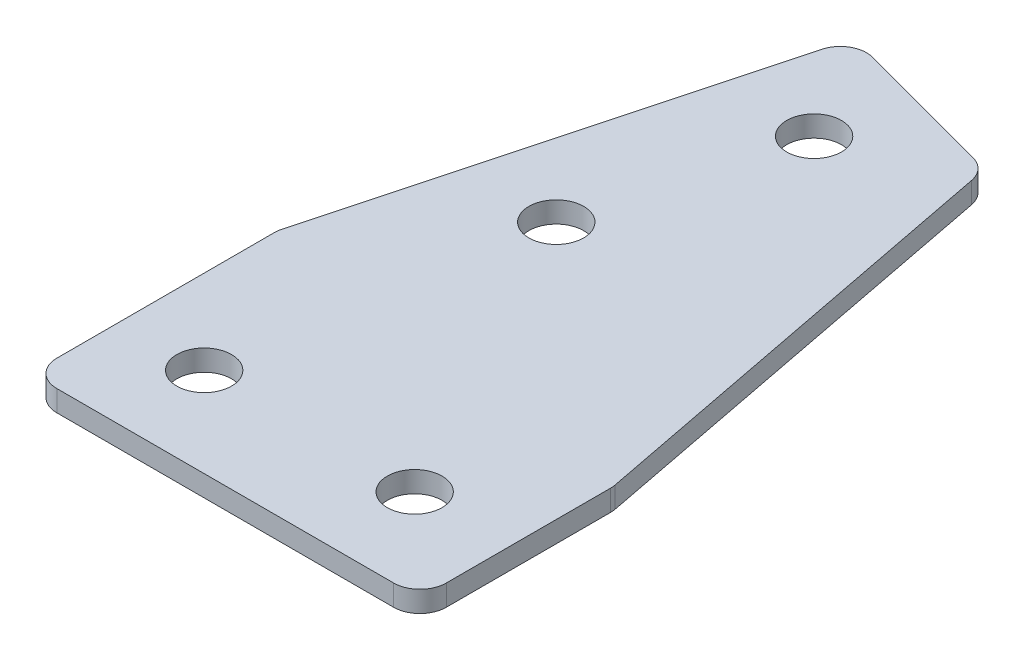
ISO-10303-21;
HEADER;
FILE_DESCRIPTION(('STEP AP214'),'2;1');
FILE_NAME('part.step','',(''),(''),'','','');
FILE_SCHEMA(('AUTOMOTIVE_DESIGN { 1 0 10303 214 1 1 1 1 }'));
ENDSEC;
DATA;
#1=APPLICATION_CONTEXT('core data for automotive mechanical design processes');
#2=APPLICATION_PROTOCOL_DEFINITION('international standard','automotive_design',2000,#1);
#3=PRODUCT_CONTEXT('',#1,'mechanical');
#4=PRODUCT('Part','Part','',(#3));
#5=PRODUCT_RELATED_PRODUCT_CATEGORY('part','',(#4));
#6=PRODUCT_DEFINITION_FORMATION('','',#4);
#7=PRODUCT_DEFINITION_CONTEXT('part definition',#1,'design');
#8=PRODUCT_DEFINITION('design','',#6,#7);
#9=PRODUCT_DEFINITION_SHAPE('','',#8);
#10=(LENGTH_UNIT() NAMED_UNIT(*) SI_UNIT(.MILLI.,.METRE.));
#11=(NAMED_UNIT(*) PLANE_ANGLE_UNIT() SI_UNIT($,.RADIAN.));
#12=(NAMED_UNIT(*) SI_UNIT($,.STERADIAN.) SOLID_ANGLE_UNIT());
#13=UNCERTAINTY_MEASURE_WITH_UNIT(LENGTH_MEASURE(1.E-05),#10,'distance_accuracy_value','');
#14=(GEOMETRIC_REPRESENTATION_CONTEXT(3) GLOBAL_UNCERTAINTY_ASSIGNED_CONTEXT((#13)) GLOBAL_UNIT_ASSIGNED_CONTEXT((#10,
#11,#12)) REPRESENTATION_CONTEXT('',''));
#15=CARTESIAN_POINT('',(0.,0.,0.));
#16=DIRECTION('',(0.,0.,1.));
#17=DIRECTION('',(1.,0.,0.));
#18=AXIS2_PLACEMENT_3D('',#15,#16,#17);
#19=CARTESIAN_POINT('',(0.,0.,0.));
#20=DIRECTION('',(0.,1.,0.));
#21=DIRECTION('',(0.,0.,1.));
#22=AXIS2_PLACEMENT_3D('',#19,#20,#21);
#23=PLANE('',#22);
#24=CARTESIAN_POINT('',(23.2137372026378,0.,0.));
#25=DIRECTION('',(0.,1.,0.));
#26=DIRECTION('',(0.,0.,1.));
#27=AXIS2_PLACEMENT_3D('',#24,#25,#26);
#28=CIRCLE('',#27,2.6);
#29=CARTESIAN_POINT('',(23.2137372026378,0.,2.6));
#30=VERTEX_POINT('',#29);
#31=EDGE_CURVE('E349',#30,#30,#28,.T.);
#32=ORIENTED_EDGE('',*,*,#31,.T.);
#33=EDGE_LOOP('',(#32));
#34=FACE_BOUND('',#33,.T.);
#35=CARTESIAN_POINT('',(12.9246670761904,0.,-48.2355141992285));
#36=DIRECTION('',(0.,1.,0.));
#37=DIRECTION('',(0.,0.,1.));
#38=AXIS2_PLACEMENT_3D('',#35,#36,#37);
#39=CIRCLE('',#38,2.60000000000001);
#40=CARTESIAN_POINT('',(12.9246670761904,0.,-45.6355141992285));
#41=VERTEX_POINT('',#40);
#42=EDGE_CURVE('E343',#41,#41,#39,.T.);
#43=ORIENTED_EDGE('',*,*,#42,.T.);
#44=EDGE_LOOP('',(#43));
#45=FACE_BOUND('',#44,.T.);
#46=CARTESIAN_POINT('',(7.74828617414003,0.,-28.9169976734471));
#47=DIRECTION('',(0.,1.,0.));
#48=DIRECTION('',(0.,0.,1.));
#49=AXIS2_PLACEMENT_3D('',#46,#47,#48);
#50=CIRCLE('',#49,2.6);
#51=CARTESIAN_POINT('',(7.74828617414003,0.,-26.3169976734471));
#52=VERTEX_POINT('',#51);
#53=EDGE_CURVE('E359',#52,#52,#50,.T.);
#54=ORIENTED_EDGE('',*,*,#53,.T.);
#55=EDGE_LOOP('',(#54));
#56=FACE_BOUND('',#55,.T.);
#57=CARTESIAN_POINT('',(3.2137372026378,0.,0.));
#58=DIRECTION('',(0.,1.,0.));
#59=DIRECTION('',(0.,0.,1.));
#60=AXIS2_PLACEMENT_3D('',#57,#58,#59);
#61=CIRCLE('',#60,2.6);
#62=CARTESIAN_POINT('',(3.2137372026378,0.,2.60000000000001));
#63=VERTEX_POINT('',#62);
#64=EDGE_CURVE('E255',#63,#63,#61,.T.);
#65=ORIENTED_EDGE('',*,*,#64,.T.);
#66=EDGE_LOOP('',(#65));
#67=FACE_BOUND('',#66,.T.);
#68=DIRECTION('',(0.,0.,-1.));
#69=VECTOR('',#68,1.);
#70=CARTESIAN_POINT('',(32.2137372026378,0.,8.50000000000013));
#71=LINE('',#70,#69);
#72=CARTESIAN_POINT('',(32.2137372026378,0.,6.00000000000013));
#73=VERTEX_POINT('',#72);
#74=CARTESIAN_POINT('',(32.2137372026378,0.,-9.61665780509915));
#75=VERTEX_POINT('',#74);
#76=EDGE_CURVE('E238',#73,#75,#71,.T.);
#77=ORIENTED_EDGE('',*,*,#76,.F.);
#78=CARTESIAN_POINT('',(29.7137372026378,0.,6.00000000000013));
#79=DIRECTION('',(0.,1.,0.));
#80=DIRECTION('',(0.,0.,1.));
#81=AXIS2_PLACEMENT_3D('',#78,#79,#80);
#82=CIRCLE('',#81,2.5);
#83=CARTESIAN_POINT('',(29.7137372026378,0.,8.50000000000013));
#84=VERTEX_POINT('',#83);
#85=EDGE_CURVE('E204',#73,#84,#82,.F.);
#86=ORIENTED_EDGE('',*,*,#85,.T.);
#87=DIRECTION('',(1.,0.,0.));
#88=VECTOR('',#87,1.);
#89=CARTESIAN_POINT('',(-4.78626279736219,0.,8.50000000000013));
#90=LINE('',#89,#88);
#91=CARTESIAN_POINT('',(-2.28626279736219,0.,8.50000000000013));
#92=VERTEX_POINT('',#91);
#93=EDGE_CURVE('E232',#92,#84,#90,.T.);
#94=ORIENTED_EDGE('',*,*,#93,.F.);
#95=CARTESIAN_POINT('',(-2.28626279736219,0.,6.00000000000013));
#96=DIRECTION('',(0.,1.,0.));
#97=DIRECTION('',(0.,0.,1.));
#98=AXIS2_PLACEMENT_3D('',#95,#96,#97);
#99=CIRCLE('',#98,2.5);
#100=CARTESIAN_POINT('',(-4.78626279736219,0.,6.00000000000013));
#101=VERTEX_POINT('',#100);
#102=EDGE_CURVE('E59',#92,#101,#99,.F.);
#103=ORIENTED_EDGE('',*,*,#102,.T.);
#104=DIRECTION('',(0.,0.,1.));
#105=VECTOR('',#104,1.);
#106=CARTESIAN_POINT('',(-4.78626279736219,0.,-14.9789021556695));
#107=LINE('',#106,#105);
#108=CARTESIAN_POINT('',(-4.78626279736219,0.,-14.649770911701));
#109=VERTEX_POINT('',#108);
#110=EDGE_CURVE('E229',#109,#101,#107,.T.);
#111=ORIENTED_EDGE('',*,*,#110,.F.);
#112=CARTESIAN_POINT('',(-2.28626279736219,0.,-14.649770911701));
#113=DIRECTION('',(0.,1.,0.));
#114=DIRECTION('',(0.,0.,1.));
#115=AXIS2_PLACEMENT_3D('',#112,#113,#114);
#116=CIRCLE('',#115,2.5);
#117=CARTESIAN_POINT('',(-4.70107736308486,0.,-15.2968185244573));
#118=VERTEX_POINT('',#117);
#119=EDGE_CURVE('E195',#109,#118,#116,.F.);
#120=ORIENTED_EDGE('',*,*,#119,.T.);
#121=DIRECTION('',(-0.258819045102518,0.,0.965925826289069));
#122=VECTOR('',#121,1.);
#123=CARTESIAN_POINT('',(6.78484991355328,0.,-58.1628826929125));
#124=LINE('',#123,#122);
#125=CARTESIAN_POINT('',(6.13780230079699,0.,-55.7480681271898));
#126=VERTEX_POINT('',#125);
#127=EDGE_CURVE('E233',#126,#118,#124,.T.);
#128=ORIENTED_EDGE('',*,*,#127,.F.);
#129=CARTESIAN_POINT('',(8.55261686651966,0.,-55.1010205144335));
#130=DIRECTION('',(0.,1.,0.));
#131=DIRECTION('',(0.,0.,1.));
#132=AXIS2_PLACEMENT_3D('',#129,#130,#131);
#133=CIRCLE('',#132,2.5);
#134=CARTESIAN_POINT('',(9.19966447927595,0.,-57.5158350801562));
#135=VERTEX_POINT('',#134);
#136=EDGE_CURVE('E190',#126,#135,#133,.F.);
#137=ORIENTED_EDGE('',*,*,#136,.T.);
#138=DIRECTION('',(-0.965925826289069,0.,-0.258819045102517));
#139=VECTOR('',#138,1.);
#140=CARTESIAN_POINT('',(23.7482060008003,0.,-53.6175651284132));
#141=LINE('',#140,#139);
#142=CARTESIAN_POINT('',(22.2377531689653,0.,-54.0222897449087));
#143=VERTEX_POINT('',#142);
#144=EDGE_CURVE('E158',#143,#135,#141,.T.);
#145=ORIENTED_EDGE('',*,*,#144,.F.);
#146=CARTESIAN_POINT('',(21.590705556209,0.,-51.607475179186));
#147=DIRECTION('',(0.,1.,0.));
#148=DIRECTION('',(0.,0.,1.));
#149=AXIS2_PLACEMENT_3D('',#146,#147,#148);
#150=CIRCLE('',#149,2.5);
#151=CARTESIAN_POINT('',(24.0452012265613,0.,-52.082291990411));
#152=VERTEX_POINT('',#151);
#153=EDGE_CURVE('E198',#143,#152,#150,.F.);
#154=ORIENTED_EDGE('',*,*,#153,.T.);
#155=DIRECTION('',(-0.18992672448999,0.,-0.981798268140917));
#156=VECTOR('',#155,1.);
#157=CARTESIAN_POINT('',(32.2137372026378,0.,-9.85624667691222));
#158=LINE('',#157,#156);
#159=CARTESIAN_POINT('',(32.1682328729901,0.,-10.0914746163241));
#160=VERTEX_POINT('',#159);
#161=EDGE_CURVE('E165',#160,#152,#158,.T.);
#162=ORIENTED_EDGE('',*,*,#161,.F.);
#163=CARTESIAN_POINT('',(29.7137372026378,0.,-9.61665780509915));
#164=DIRECTION('',(0.,1.,0.));
#165=DIRECTION('',(0.,0.,1.));
#166=AXIS2_PLACEMENT_3D('',#163,#164,#165);
#167=CIRCLE('',#166,2.5);
#168=EDGE_CURVE('E201',#160,#75,#167,.F.);
#169=ORIENTED_EDGE('',*,*,#168,.T.);
#170=EDGE_LOOP('',(#77,#86,#94,#103,#111,#120,#128,#137,#145,#154,#162,#169));
#171=FACE_BOUND('',#170,.T.);
#172=ADVANCED_FACE('F43',(#34,#45,#56,#67,#171),#23,.F.);
#173=CARTESIAN_POINT('',(6.78484991355328,0.,-58.1628826929125));
#174=DIRECTION('',(-0.965925826289069,0.,-0.258819045102518));
#175=DIRECTION('',(-0.258819045102518,0.,0.965925826289069));
#176=AXIS2_PLACEMENT_3D('',#173,#174,#175);
#177=PLANE('',#176);
#178=ORIENTED_EDGE('',*,*,#127,.T.);
#179=DIRECTION('',(0.,1.,0.));
#180=VECTOR('',#179,1.);
#181=CARTESIAN_POINT('',(-4.70107736308486,0.,-15.2968185244573));
#182=LINE('',#181,#180);
#183=CARTESIAN_POINT('',(-4.70107736308486,2.,-15.2968185244573));
#184=VERTEX_POINT('',#183);
#185=EDGE_CURVE('E224',#118,#184,#182,.T.);
#186=ORIENTED_EDGE('',*,*,#185,.T.);
#187=DIRECTION('',(-0.258819045102518,0.,0.965925826289069));
#188=VECTOR('',#187,1.);
#189=CARTESIAN_POINT('',(6.78484991355328,2.,-58.1628826929125));
#190=LINE('',#189,#188);
#191=CARTESIAN_POINT('',(6.13780230079699,2.,-55.7480681271898));
#192=VERTEX_POINT('',#191);
#193=EDGE_CURVE('E251',#192,#184,#190,.T.);
#194=ORIENTED_EDGE('',*,*,#193,.F.);
#195=DIRECTION('',(0.,1.,0.));
#196=VECTOR('',#195,1.);
#197=CARTESIAN_POINT('',(6.13780230079699,0.,-55.7480681271898));
#198=LINE('',#197,#196);
#199=EDGE_CURVE('E221',#192,#126,#198,.F.);
#200=ORIENTED_EDGE('',*,*,#199,.T.);
#201=EDGE_LOOP('',(#178,#186,#194,#200));
#202=FACE_BOUND('',#201,.T.);
#203=ADVANCED_FACE('F305',(#202),#177,.T.);
#204=CARTESIAN_POINT('',(23.7482060008003,0.,-53.6175651284132));
#205=DIRECTION('',(0.258819045102517,0.,-0.965925826289069));
#206=DIRECTION('',(-0.965925826289069,0.,-0.258819045102517));
#207=AXIS2_PLACEMENT_3D('',#204,#205,#206);
#208=PLANE('',#207);
#209=DIRECTION('',(-0.965925826289069,0.,-0.258819045102517));
#210=VECTOR('',#209,1.);
#211=CARTESIAN_POINT('',(23.7482060008003,2.,-53.6175651284132));
#212=LINE('',#211,#210);
#213=CARTESIAN_POINT('',(22.2377531689653,2.,-54.0222897449087));
#214=VERTEX_POINT('',#213);
#215=CARTESIAN_POINT('',(9.19966447927595,2.,-57.5158350801562));
#216=VERTEX_POINT('',#215);
#217=EDGE_CURVE('E168',#214,#216,#212,.T.);
#218=ORIENTED_EDGE('',*,*,#217,.F.);
#219=DIRECTION('',(0.,1.,0.));
#220=VECTOR('',#219,1.);
#221=CARTESIAN_POINT('',(22.2377531689653,0.,-54.0222897449087));
#222=LINE('',#221,#220);
#223=EDGE_CURVE('E218',#214,#143,#222,.F.);
#224=ORIENTED_EDGE('',*,*,#223,.T.);
#225=ORIENTED_EDGE('',*,*,#144,.T.);
#226=DIRECTION('',(0.,1.,0.));
#227=VECTOR('',#226,1.);
#228=CARTESIAN_POINT('',(9.19966447927595,0.,-57.5158350801562));
#229=LINE('',#228,#227);
#230=EDGE_CURVE('E214',#135,#216,#229,.T.);
#231=ORIENTED_EDGE('',*,*,#230,.T.);
#232=EDGE_LOOP('',(#218,#224,#225,#231));
#233=FACE_BOUND('',#232,.T.);
#234=ADVANCED_FACE('F269',(#233),#208,.T.);
#235=CARTESIAN_POINT('',(32.2137372026378,0.,-9.85624667691222));
#236=DIRECTION('',(0.981798268140917,0.,-0.18992672448999));
#237=DIRECTION('',(-0.18992672448999,0.,-0.981798268140917));
#238=AXIS2_PLACEMENT_3D('',#235,#236,#237);
#239=PLANE('',#238);
#240=DIRECTION('',(-0.18992672448999,0.,-0.981798268140917));
#241=VECTOR('',#240,1.);
#242=CARTESIAN_POINT('',(32.2137372026378,2.,-9.85624667691222));
#243=LINE('',#242,#241);
#244=CARTESIAN_POINT('',(32.1682328729901,2.,-10.0914746163241));
#245=VERTEX_POINT('',#244);
#246=CARTESIAN_POINT('',(24.0452012265613,2.,-52.082291990411));
#247=VERTEX_POINT('',#246);
#248=EDGE_CURVE('E260',#245,#247,#243,.T.);
#249=ORIENTED_EDGE('',*,*,#248,.F.);
#250=DIRECTION('',(0.,1.,0.));
#251=VECTOR('',#250,1.);
#252=CARTESIAN_POINT('',(32.1682328729901,0.,-10.0914746163241));
#253=LINE('',#252,#251);
#254=EDGE_CURVE('E211',#245,#160,#253,.F.);
#255=ORIENTED_EDGE('',*,*,#254,.T.);
#256=ORIENTED_EDGE('',*,*,#161,.T.);
#257=DIRECTION('',(0.,1.,0.));
#258=VECTOR('',#257,1.);
#259=CARTESIAN_POINT('',(24.0452012265613,0.,-52.082291990411));
#260=LINE('',#259,#258);
#261=EDGE_CURVE('E207',#152,#247,#260,.T.);
#262=ORIENTED_EDGE('',*,*,#261,.T.);
#263=EDGE_LOOP('',(#249,#255,#256,#262));
#264=FACE_BOUND('',#263,.T.);
#265=ADVANCED_FACE('F280',(#264),#239,.T.);
#266=CARTESIAN_POINT('',(32.2137372026378,0.,8.50000000000013));
#267=DIRECTION('',(1.,0.,0.));
#268=DIRECTION('',(0.,0.,-1.));
#269=AXIS2_PLACEMENT_3D('',#266,#267,#268);
#270=PLANE('',#269);
#271=DIRECTION('',(0.,0.,-1.));
#272=VECTOR('',#271,1.);
#273=CARTESIAN_POINT('',(32.2137372026378,2.,8.50000000000013));
#274=LINE('',#273,#272);
#275=CARTESIAN_POINT('',(32.2137372026378,2.,6.00000000000013));
#276=VERTEX_POINT('',#275);
#277=CARTESIAN_POINT('',(32.2137372026378,2.,-9.61665780509915));
#278=VERTEX_POINT('',#277);
#279=EDGE_CURVE('E154',#276,#278,#274,.T.);
#280=ORIENTED_EDGE('',*,*,#279,.F.);
#281=DIRECTION('',(0.,1.,0.));
#282=VECTOR('',#281,1.);
#283=CARTESIAN_POINT('',(32.2137372026378,0.,6.00000000000013));
#284=LINE('',#283,#282);
#285=EDGE_CURVE('E188',#276,#73,#284,.F.);
#286=ORIENTED_EDGE('',*,*,#285,.T.);
#287=ORIENTED_EDGE('',*,*,#76,.T.);
#288=DIRECTION('',(0.,1.,0.));
#289=VECTOR('',#288,1.);
#290=CARTESIAN_POINT('',(32.2137372026378,0.,-9.61665780509915));
#291=LINE('',#290,#289);
#292=EDGE_CURVE('E184',#75,#278,#291,.T.);
#293=ORIENTED_EDGE('',*,*,#292,.T.);
#294=EDGE_LOOP('',(#280,#286,#287,#293));
#295=FACE_BOUND('',#294,.T.);
#296=ADVANCED_FACE('F288',(#295),#270,.T.);
#297=CARTESIAN_POINT('',(-4.78626279736219,0.,8.50000000000013));
#298=DIRECTION('',(0.,0.,1.));
#299=DIRECTION('',(1.,0.,0.));
#300=AXIS2_PLACEMENT_3D('',#297,#298,#299);
#301=PLANE('',#300);
#302=ORIENTED_EDGE('',*,*,#93,.T.);
#303=DIRECTION('',(0.,1.,0.));
#304=VECTOR('',#303,1.);
#305=CARTESIAN_POINT('',(29.7137372026378,0.,8.50000000000013));
#306=LINE('',#305,#304);
#307=CARTESIAN_POINT('',(29.7137372026378,2.,8.50000000000013));
#308=VERTEX_POINT('',#307);
#309=EDGE_CURVE('E152',#84,#308,#306,.T.);
#310=ORIENTED_EDGE('',*,*,#309,.T.);
#311=DIRECTION('',(1.,0.,0.));
#312=VECTOR('',#311,1.);
#313=CARTESIAN_POINT('',(-4.78626279736219,2.,8.50000000000013));
#314=LINE('',#313,#312);
#315=CARTESIAN_POINT('',(-2.28626279736219,2.,8.50000000000013));
#316=VERTEX_POINT('',#315);
#317=EDGE_CURVE('E136',#316,#308,#314,.T.);
#318=ORIENTED_EDGE('',*,*,#317,.F.);
#319=DIRECTION('',(0.,1.,0.));
#320=VECTOR('',#319,1.);
#321=CARTESIAN_POINT('',(-2.28626279736219,0.,8.50000000000013));
#322=LINE('',#321,#320);
#323=EDGE_CURVE('E150',#316,#92,#322,.F.);
#324=ORIENTED_EDGE('',*,*,#323,.T.);
#325=EDGE_LOOP('',(#302,#310,#318,#324));
#326=FACE_BOUND('',#325,.T.);
#327=ADVANCED_FACE('F149',(#326),#301,.T.);
#328=CARTESIAN_POINT('',(-4.78626279736219,0.,-14.9789021556695));
#329=DIRECTION('',(-1.,0.,0.));
#330=DIRECTION('',(0.,0.,1.));
#331=AXIS2_PLACEMENT_3D('',#328,#329,#330);
#332=PLANE('',#331);
#333=DIRECTION('',(0.,0.,1.));
#334=VECTOR('',#333,1.);
#335=CARTESIAN_POINT('',(-4.78626279736219,2.,-14.9789021556695));
#336=LINE('',#335,#334);
#337=CARTESIAN_POINT('',(-4.78626279736219,2.,-14.649770911701));
#338=VERTEX_POINT('',#337);
#339=CARTESIAN_POINT('',(-4.78626279736219,2.,6.00000000000013));
#340=VERTEX_POINT('',#339);
#341=EDGE_CURVE('E137',#338,#340,#336,.T.);
#342=ORIENTED_EDGE('',*,*,#341,.F.);
#343=DIRECTION('',(0.,1.,0.));
#344=VECTOR('',#343,1.);
#345=CARTESIAN_POINT('',(-4.78626279736219,0.,-14.649770911701));
#346=LINE('',#345,#344);
#347=EDGE_CURVE('E12',#338,#109,#346,.F.);
#348=ORIENTED_EDGE('',*,*,#347,.T.);
#349=ORIENTED_EDGE('',*,*,#110,.T.);
#350=DIRECTION('',(0.,1.,0.));
#351=VECTOR('',#350,1.);
#352=CARTESIAN_POINT('',(-4.78626279736219,0.,6.00000000000013));
#353=LINE('',#352,#351);
#354=EDGE_CURVE('E52',#101,#340,#353,.T.);
#355=ORIENTED_EDGE('',*,*,#354,.T.);
#356=EDGE_LOOP('',(#342,#348,#349,#355));
#357=FACE_BOUND('',#356,.T.);
#358=ADVANCED_FACE('F228',(#357),#332,.T.);
#359=CARTESIAN_POINT('',(0.,2.,0.));
#360=DIRECTION('',(0.,1.,0.));
#361=DIRECTION('',(0.,0.,1.));
#362=AXIS2_PLACEMENT_3D('',#359,#360,#361);
#363=PLANE('',#362);
#364=CARTESIAN_POINT('',(23.2137372026378,2.,0.));
#365=DIRECTION('',(0.,1.,0.));
#366=DIRECTION('',(0.,0.,1.));
#367=AXIS2_PLACEMENT_3D('',#364,#365,#366);
#368=CIRCLE('',#367,2.6);
#369=CARTESIAN_POINT('',(23.2137372026378,2.,2.6));
#370=VERTEX_POINT('',#369);
#371=EDGE_CURVE('E355',#370,#370,#368,.T.);
#372=ORIENTED_EDGE('',*,*,#371,.F.);
#373=EDGE_LOOP('',(#372));
#374=FACE_BOUND('',#373,.T.);
#375=CARTESIAN_POINT('',(12.9246670761904,2.,-48.2355141992285));
#376=DIRECTION('',(0.,1.,0.));
#377=DIRECTION('',(0.,0.,1.));
#378=AXIS2_PLACEMENT_3D('',#375,#376,#377);
#379=CIRCLE('',#378,2.60000000000001);
#380=CARTESIAN_POINT('',(12.9246670761904,2.,-45.6355141992285));
#381=VERTEX_POINT('',#380);
#382=EDGE_CURVE('E346',#381,#381,#379,.T.);
#383=ORIENTED_EDGE('',*,*,#382,.F.);
#384=EDGE_LOOP('',(#383));
#385=FACE_BOUND('',#384,.T.);
#386=CARTESIAN_POINT('',(7.74828617414003,2.,-28.9169976734471));
#387=DIRECTION('',(0.,1.,0.));
#388=DIRECTION('',(0.,0.,1.));
#389=AXIS2_PLACEMENT_3D('',#386,#387,#388);
#390=CIRCLE('',#389,2.6);
#391=CARTESIAN_POINT('',(7.74828617414003,2.,-26.3169976734471));
#392=VERTEX_POINT('',#391);
#393=EDGE_CURVE('E353',#392,#392,#390,.T.);
#394=ORIENTED_EDGE('',*,*,#393,.F.);
#395=EDGE_LOOP('',(#394));
#396=FACE_BOUND('',#395,.T.);
#397=CARTESIAN_POINT('',(3.2137372026378,2.,0.));
#398=DIRECTION('',(0.,1.,0.));
#399=DIRECTION('',(0.,0.,1.));
#400=AXIS2_PLACEMENT_3D('',#397,#398,#399);
#401=CIRCLE('',#400,2.6);
#402=CARTESIAN_POINT('',(3.2137372026378,2.,2.60000000000001));
#403=VERTEX_POINT('',#402);
#404=EDGE_CURVE('E362',#403,#403,#401,.T.);
#405=ORIENTED_EDGE('',*,*,#404,.F.);
#406=EDGE_LOOP('',(#405));
#407=FACE_BOUND('',#406,.T.);
#408=ORIENTED_EDGE('',*,*,#317,.T.);
#409=CARTESIAN_POINT('',(29.7137372026378,2.,6.00000000000013));
#410=DIRECTION('',(0.,1.,0.));
#411=DIRECTION('',(0.,0.,1.));
#412=AXIS2_PLACEMENT_3D('',#409,#410,#411);
#413=CIRCLE('',#412,2.5);
#414=EDGE_CURVE('E181',#308,#276,#413,.T.);
#415=ORIENTED_EDGE('',*,*,#414,.T.);
#416=ORIENTED_EDGE('',*,*,#279,.T.);
#417=CARTESIAN_POINT('',(29.7137372026378,2.,-9.61665780509915));
#418=DIRECTION('',(0.,1.,0.));
#419=DIRECTION('',(0.,0.,1.));
#420=AXIS2_PLACEMENT_3D('',#417,#418,#419);
#421=CIRCLE('',#420,2.5);
#422=EDGE_CURVE('E178',#278,#245,#421,.T.);
#423=ORIENTED_EDGE('',*,*,#422,.T.);
#424=ORIENTED_EDGE('',*,*,#248,.T.);
#425=CARTESIAN_POINT('',(21.590705556209,2.,-51.607475179186));
#426=DIRECTION('',(0.,1.,0.));
#427=DIRECTION('',(0.,0.,1.));
#428=AXIS2_PLACEMENT_3D('',#425,#426,#427);
#429=CIRCLE('',#428,2.5);
#430=EDGE_CURVE('E175',#247,#214,#429,.T.);
#431=ORIENTED_EDGE('',*,*,#430,.T.);
#432=ORIENTED_EDGE('',*,*,#217,.T.);
#433=CARTESIAN_POINT('',(8.55261686651966,2.,-55.1010205144335));
#434=DIRECTION('',(0.,1.,0.));
#435=DIRECTION('',(0.,0.,1.));
#436=AXIS2_PLACEMENT_3D('',#433,#434,#435);
#437=CIRCLE('',#436,2.5);
#438=EDGE_CURVE('E144',#216,#192,#437,.T.);
#439=ORIENTED_EDGE('',*,*,#438,.T.);
#440=ORIENTED_EDGE('',*,*,#193,.T.);
#441=CARTESIAN_POINT('',(-2.28626279736219,2.,-14.649770911701));
#442=DIRECTION('',(0.,1.,0.));
#443=DIRECTION('',(0.,0.,1.));
#444=AXIS2_PLACEMENT_3D('',#441,#442,#443);
#445=CIRCLE('',#444,2.5);
#446=EDGE_CURVE('E143',#184,#338,#445,.T.);
#447=ORIENTED_EDGE('',*,*,#446,.T.);
#448=ORIENTED_EDGE('',*,*,#341,.T.);
#449=CARTESIAN_POINT('',(-2.28626279736219,2.,6.00000000000013));
#450=DIRECTION('',(0.,1.,0.));
#451=DIRECTION('',(0.,0.,1.));
#452=AXIS2_PLACEMENT_3D('',#449,#450,#451);
#453=CIRCLE('',#452,2.5);
#454=EDGE_CURVE('E133',#340,#316,#453,.T.);
#455=ORIENTED_EDGE('',*,*,#454,.T.);
#456=EDGE_LOOP('',(#408,#415,#416,#423,#424,#431,#432,#439,#440,#447,#448,#455));
#457=FACE_BOUND('',#456,.T.);
#458=ADVANCED_FACE('F135',(#374,#385,#396,#407,#457),#363,.T.);
#459=CARTESIAN_POINT('',(3.2137372026378,0.,0.));
#460=DIRECTION('',(0.,1.,0.));
#461=DIRECTION('',(0.,0.,1.));
#462=AXIS2_PLACEMENT_3D('',#459,#460,#461);
#463=CYLINDRICAL_SURFACE('',#462,2.6);
#464=ORIENTED_EDGE('',*,*,#64,.F.);
#465=EDGE_LOOP('',(#464));
#466=FACE_BOUND('',#465,.T.);
#467=ORIENTED_EDGE('',*,*,#404,.T.);
#468=EDGE_LOOP('',(#467));
#469=FACE_BOUND('',#468,.T.);
#470=ADVANCED_FACE('F316',(#466,#469),#463,.F.);
#471=CARTESIAN_POINT('',(7.74828617414003,0.,-28.9169976734471));
#472=DIRECTION('',(0.,1.,0.));
#473=DIRECTION('',(0.,0.,1.));
#474=AXIS2_PLACEMENT_3D('',#471,#472,#473);
#475=CYLINDRICAL_SURFACE('',#474,2.6);
#476=ORIENTED_EDGE('',*,*,#53,.F.);
#477=EDGE_LOOP('',(#476));
#478=FACE_BOUND('',#477,.T.);
#479=ORIENTED_EDGE('',*,*,#393,.T.);
#480=EDGE_LOOP('',(#479));
#481=FACE_BOUND('',#480,.T.);
#482=ADVANCED_FACE('F331',(#478,#481),#475,.F.);
#483=CARTESIAN_POINT('',(12.9246670761904,0.,-48.2355141992285));
#484=DIRECTION('',(0.,1.,0.));
#485=DIRECTION('',(0.,0.,1.));
#486=AXIS2_PLACEMENT_3D('',#483,#484,#485);
#487=CYLINDRICAL_SURFACE('',#486,2.60000000000001);
#488=ORIENTED_EDGE('',*,*,#42,.F.);
#489=EDGE_LOOP('',(#488));
#490=FACE_BOUND('',#489,.T.);
#491=ORIENTED_EDGE('',*,*,#382,.T.);
#492=EDGE_LOOP('',(#491));
#493=FACE_BOUND('',#492,.T.);
#494=ADVANCED_FACE('F300',(#490,#493),#487,.F.);
#495=CARTESIAN_POINT('',(23.2137372026378,0.,0.));
#496=DIRECTION('',(0.,1.,0.));
#497=DIRECTION('',(0.,0.,1.));
#498=AXIS2_PLACEMENT_3D('',#495,#496,#497);
#499=CYLINDRICAL_SURFACE('',#498,2.6);
#500=ORIENTED_EDGE('',*,*,#31,.F.);
#501=EDGE_LOOP('',(#500));
#502=FACE_BOUND('',#501,.T.);
#503=ORIENTED_EDGE('',*,*,#371,.T.);
#504=EDGE_LOOP('',(#503));
#505=FACE_BOUND('',#504,.T.);
#506=ADVANCED_FACE('F293',(#502,#505),#499,.F.);
#507=CARTESIAN_POINT('',(29.7137372026378,0.,6.00000000000013));
#508=DIRECTION('',(0.,1.,0.));
#509=DIRECTION('',(0.,0.,1.));
#510=AXIS2_PLACEMENT_3D('',#507,#508,#509);
#511=CYLINDRICAL_SURFACE('',#510,2.5);
#512=ORIENTED_EDGE('',*,*,#85,.F.);
#513=ORIENTED_EDGE('',*,*,#285,.F.);
#514=ORIENTED_EDGE('',*,*,#414,.F.);
#515=ORIENTED_EDGE('',*,*,#309,.F.);
#516=EDGE_LOOP('',(#512,#513,#514,#515));
#517=FACE_BOUND('',#516,.T.);
#518=ADVANCED_FACE('F291',(#517),#511,.T.);
#519=CARTESIAN_POINT('',(29.7137372026378,0.,-9.61665780509915));
#520=DIRECTION('',(0.,1.,0.));
#521=DIRECTION('',(0.,0.,1.));
#522=AXIS2_PLACEMENT_3D('',#519,#520,#521);
#523=CYLINDRICAL_SURFACE('',#522,2.5);
#524=ORIENTED_EDGE('',*,*,#168,.F.);
#525=ORIENTED_EDGE('',*,*,#254,.F.);
#526=ORIENTED_EDGE('',*,*,#422,.F.);
#527=ORIENTED_EDGE('',*,*,#292,.F.);
#528=EDGE_LOOP('',(#524,#525,#526,#527));
#529=FACE_BOUND('',#528,.T.);
#530=ADVANCED_FACE('F283',(#529),#523,.T.);
#531=CARTESIAN_POINT('',(21.590705556209,0.,-51.607475179186));
#532=DIRECTION('',(0.,1.,0.));
#533=DIRECTION('',(0.,0.,1.));
#534=AXIS2_PLACEMENT_3D('',#531,#532,#533);
#535=CYLINDRICAL_SURFACE('',#534,2.5);
#536=ORIENTED_EDGE('',*,*,#153,.F.);
#537=ORIENTED_EDGE('',*,*,#223,.F.);
#538=ORIENTED_EDGE('',*,*,#430,.F.);
#539=ORIENTED_EDGE('',*,*,#261,.F.);
#540=EDGE_LOOP('',(#536,#537,#538,#539));
#541=FACE_BOUND('',#540,.T.);
#542=ADVANCED_FACE('F274',(#541),#535,.T.);
#543=CARTESIAN_POINT('',(-2.28626279736219,0.,-14.649770911701));
#544=DIRECTION('',(0.,1.,0.));
#545=DIRECTION('',(0.,0.,1.));
#546=AXIS2_PLACEMENT_3D('',#543,#544,#545);
#547=CYLINDRICAL_SURFACE('',#546,2.5);
#548=ORIENTED_EDGE('',*,*,#119,.F.);
#549=ORIENTED_EDGE('',*,*,#347,.F.);
#550=ORIENTED_EDGE('',*,*,#446,.F.);
#551=ORIENTED_EDGE('',*,*,#185,.F.);
#552=EDGE_LOOP('',(#548,#549,#550,#551));
#553=FACE_BOUND('',#552,.T.);
#554=ADVANCED_FACE('F407',(#553),#547,.T.);
#555=CARTESIAN_POINT('',(-2.28626279736219,0.,6.00000000000013));
#556=DIRECTION('',(0.,1.,0.));
#557=DIRECTION('',(0.,0.,1.));
#558=AXIS2_PLACEMENT_3D('',#555,#556,#557);
#559=CYLINDRICAL_SURFACE('',#558,2.5);
#560=ORIENTED_EDGE('',*,*,#102,.F.);
#561=ORIENTED_EDGE('',*,*,#323,.F.);
#562=ORIENTED_EDGE('',*,*,#454,.F.);
#563=ORIENTED_EDGE('',*,*,#354,.F.);
#564=EDGE_LOOP('',(#560,#561,#562,#563));
#565=FACE_BOUND('',#564,.T.);
#566=ADVANCED_FACE('F156',(#565),#559,.T.);
#567=CARTESIAN_POINT('',(8.55261686651966,0.,-55.1010205144335));
#568=DIRECTION('',(0.,1.,0.));
#569=DIRECTION('',(0.,0.,1.));
#570=AXIS2_PLACEMENT_3D('',#567,#568,#569);
#571=CYLINDRICAL_SURFACE('',#570,2.5);
#572=ORIENTED_EDGE('',*,*,#136,.F.);
#573=ORIENTED_EDGE('',*,*,#199,.F.);
#574=ORIENTED_EDGE('',*,*,#438,.F.);
#575=ORIENTED_EDGE('',*,*,#230,.F.);
#576=EDGE_LOOP('',(#572,#573,#574,#575));
#577=FACE_BOUND('',#576,.T.);
#578=ADVANCED_FACE('F45',(#577),#571,.T.);
#579=CLOSED_SHELL('',(#172,#203,#234,#265,#296,#327,#358,#458,#470,#482,#494,#506,#518,#530,
#542,#554,#566,#578));
#580=MANIFOLD_SOLID_BREP('B2',#579);
#581=ADVANCED_BREP_SHAPE_REPRESENTATION('',(#18,#580),#14);
#582=SHAPE_DEFINITION_REPRESENTATION(#9,#581);
ENDSEC;
END-ISO-10303-21;
